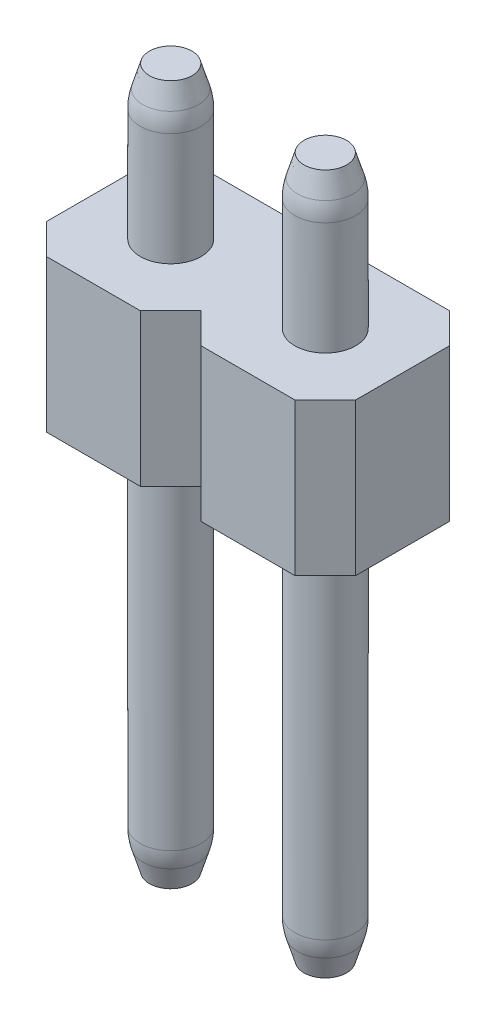
ISO-10303-21;
HEADER;
FILE_DESCRIPTION(('STEP AP214'),'2;1');
FILE_NAME('part.step','',(''),(''),'','','');
FILE_SCHEMA(('AUTOMOTIVE_DESIGN { 1 0 10303 214 1 1 1 1 }'));
ENDSEC;
DATA;
#1=APPLICATION_CONTEXT('core data for automotive mechanical design processes');
#2=APPLICATION_PROTOCOL_DEFINITION('international standard','automotive_design',2000,#1);
#3=PRODUCT_CONTEXT('',#1,'mechanical');
#4=PRODUCT('Part','Part','',(#3));
#5=PRODUCT_RELATED_PRODUCT_CATEGORY('part','',(#4));
#6=PRODUCT_DEFINITION_FORMATION('','',#4);
#7=PRODUCT_DEFINITION_CONTEXT('part definition',#1,'design');
#8=PRODUCT_DEFINITION('design','',#6,#7);
#9=PRODUCT_DEFINITION_SHAPE('','',#8);
#10=(LENGTH_UNIT() NAMED_UNIT(*) SI_UNIT(.MILLI.,.METRE.));
#11=(NAMED_UNIT(*) PLANE_ANGLE_UNIT() SI_UNIT($,.RADIAN.));
#12=(NAMED_UNIT(*) SI_UNIT($,.STERADIAN.) SOLID_ANGLE_UNIT());
#13=UNCERTAINTY_MEASURE_WITH_UNIT(LENGTH_MEASURE(1.E-05),#10,'distance_accuracy_value','');
#14=(GEOMETRIC_REPRESENTATION_CONTEXT(3) GLOBAL_UNCERTAINTY_ASSIGNED_CONTEXT((#13)) GLOBAL_UNIT_ASSIGNED_CONTEXT((#10,
#11,#12)) REPRESENTATION_CONTEXT('',''));
#15=CARTESIAN_POINT('',(0.,0.,0.));
#16=DIRECTION('',(0.,0.,1.));
#17=DIRECTION('',(1.,0.,0.));
#18=AXIS2_PLACEMENT_3D('',#15,#16,#17);
#19=CARTESIAN_POINT('',(0.,11.5,0.));
#20=DIRECTION('',(0.,-1.,0.));
#21=DIRECTION('',(0.,0.,-1.));
#22=AXIS2_PLACEMENT_3D('',#19,#20,#21);
#23=CYLINDRICAL_SURFACE('',#22,0.5);
#24=CARTESIAN_POINT('',(0.,10.8532311636965,0.));
#25=DIRECTION('',(0.,1.,0.));
#26=DIRECTION('',(0.,0.,1.));
#27=AXIS2_PLACEMENT_3D('',#24,#25,#26);
#28=CIRCLE('',#27,0.5);
#29=CARTESIAN_POINT('',(0.,10.8532311636965,0.5));
#30=VERTEX_POINT('',#29);
#31=EDGE_CURVE('E249',#30,#30,#28,.F.);
#32=ORIENTED_EDGE('',*,*,#31,.T.);
#33=EDGE_LOOP('',(#32));
#34=FACE_BOUND('',#33,.T.);
#35=CARTESIAN_POINT('',(0.,9.,0.));
#36=DIRECTION('',(0.,-1.,0.));
#37=DIRECTION('',(0.,0.,-1.));
#38=AXIS2_PLACEMENT_3D('',#35,#36,#37);
#39=CIRCLE('',#38,0.5);
#40=CARTESIAN_POINT('',(0.,9.,-0.5));
#41=VERTEX_POINT('',#40);
#42=EDGE_CURVE('E230',#41,#41,#39,.T.);
#43=ORIENTED_EDGE('',*,*,#42,.F.);
#44=EDGE_LOOP('',(#43));
#45=FACE_BOUND('',#44,.T.);
#46=ADVANCED_FACE('F40',(#34,#45),#23,.T.);
#47=CARTESIAN_POINT('',(0.,11.5,0.));
#48=DIRECTION('',(0.,1.,0.));
#49=DIRECTION('',(0.,0.,1.));
#50=AXIS2_PLACEMENT_3D('',#47,#48,#49);
#51=PLANE('',#50);
#52=CARTESIAN_POINT('',(0.,11.5,0.));
#53=DIRECTION('',(0.,1.,0.));
#54=DIRECTION('',(0.,0.,1.));
#55=AXIS2_PLACEMENT_3D('',#52,#53,#54);
#56=CIRCLE('',#55,0.350000000000005);
#57=CARTESIAN_POINT('',(0.,11.5,0.350000000000005));
#58=VERTEX_POINT('',#57);
#59=EDGE_CURVE('E240',#58,#58,#56,.T.);
#60=ORIENTED_EDGE('',*,*,#59,.T.);
#61=EDGE_LOOP('',(#60));
#62=FACE_BOUND('',#61,.T.);
#63=ADVANCED_FACE('F306',(#62),#51,.T.);
#64=CARTESIAN_POINT('',(-1.27,9.,0.77));
#65=DIRECTION('',(1.,0.,0.));
#66=DIRECTION('',(0.,0.,-1.));
#67=AXIS2_PLACEMENT_3D('',#64,#65,#66);
#68=PLANE('',#67);
#69=DIRECTION('',(0.,0.,1.));
#70=VECTOR('',#69,1.);
#71=CARTESIAN_POINT('',(-1.27,6.5,0.77));
#72=LINE('',#71,#70);
#73=CARTESIAN_POINT('',(-1.27,6.5,-0.77));
#74=VERTEX_POINT('',#73);
#75=CARTESIAN_POINT('',(-1.27,6.5,0.77));
#76=VERTEX_POINT('',#75);
#77=EDGE_CURVE('E169',#74,#76,#72,.T.);
#78=ORIENTED_EDGE('',*,*,#77,.T.);
#79=DIRECTION('',(0.,-1.,0.));
#80=VECTOR('',#79,1.);
#81=CARTESIAN_POINT('',(-1.27,9.,0.77));
#82=LINE('',#81,#80);
#83=CARTESIAN_POINT('',(-1.27,9.,0.77));
#84=VERTEX_POINT('',#83);
#85=EDGE_CURVE('E225',#84,#76,#82,.T.);
#86=ORIENTED_EDGE('',*,*,#85,.F.);
#87=DIRECTION('',(0.,0.,1.));
#88=VECTOR('',#87,1.);
#89=CARTESIAN_POINT('',(-1.27,9.,0.77));
#90=LINE('',#89,#88);
#91=CARTESIAN_POINT('',(-1.27,9.,-0.77));
#92=VERTEX_POINT('',#91);
#93=EDGE_CURVE('E195',#92,#84,#90,.T.);
#94=ORIENTED_EDGE('',*,*,#93,.F.);
#95=DIRECTION('',(0.,-1.,0.));
#96=VECTOR('',#95,1.);
#97=CARTESIAN_POINT('',(-1.27,9.,-0.77));
#98=LINE('',#97,#96);
#99=EDGE_CURVE('E165',#92,#74,#98,.T.);
#100=ORIENTED_EDGE('',*,*,#99,.T.);
#101=EDGE_LOOP('',(#78,#86,#94,#100));
#102=FACE_BOUND('',#101,.T.);
#103=ADVANCED_FACE('F311',(#102),#68,.F.);
#104=CARTESIAN_POINT('',(-1.27,9.,0.77));
#105=DIRECTION('',(0.707106781186548,0.,-0.707106781186548));
#106=DIRECTION('',(-0.707106781186548,0.,-0.707106781186548));
#107=AXIS2_PLACEMENT_3D('',#104,#105,#106);
#108=PLANE('',#107);
#109=DIRECTION('',(0.707106781186548,0.,0.707106781186548));
#110=VECTOR('',#109,1.);
#111=CARTESIAN_POINT('',(-1.27,6.5,0.77));
#112=LINE('',#111,#110);
#113=CARTESIAN_POINT('',(-0.77,6.5,1.27));
#114=VERTEX_POINT('',#113);
#115=EDGE_CURVE('E172',#76,#114,#112,.T.);
#116=ORIENTED_EDGE('',*,*,#115,.T.);
#117=DIRECTION('',(0.,-1.,0.));
#118=VECTOR('',#117,1.);
#119=CARTESIAN_POINT('',(-0.77,9.,1.27));
#120=LINE('',#119,#118);
#121=CARTESIAN_POINT('',(-0.77,9.,1.27));
#122=VERTEX_POINT('',#121);
#123=EDGE_CURVE('E222',#122,#114,#120,.T.);
#124=ORIENTED_EDGE('',*,*,#123,.F.);
#125=DIRECTION('',(0.707106781186548,0.,0.707106781186548));
#126=VECTOR('',#125,1.);
#127=CARTESIAN_POINT('',(-1.27,9.,0.77));
#128=LINE('',#127,#126);
#129=EDGE_CURVE('E117',#84,#122,#128,.T.);
#130=ORIENTED_EDGE('',*,*,#129,.F.);
#131=ORIENTED_EDGE('',*,*,#85,.T.);
#132=EDGE_LOOP('',(#116,#124,#130,#131));
#133=FACE_BOUND('',#132,.T.);
#134=ADVANCED_FACE('F405',(#133),#108,.F.);
#135=CARTESIAN_POINT('',(-0.77,9.,1.27));
#136=DIRECTION('',(0.,0.,-1.));
#137=DIRECTION('',(-1.,0.,0.));
#138=AXIS2_PLACEMENT_3D('',#135,#136,#137);
#139=PLANE('',#138);
#140=DIRECTION('',(1.,0.,0.));
#141=VECTOR('',#140,1.);
#142=CARTESIAN_POINT('',(-0.77,6.5,1.27));
#143=LINE('',#142,#141);
#144=CARTESIAN_POINT('',(0.77,6.5,1.27));
#145=VERTEX_POINT('',#144);
#146=EDGE_CURVE('E175',#114,#145,#143,.T.);
#147=ORIENTED_EDGE('',*,*,#146,.T.);
#148=DIRECTION('',(0.,-1.,0.));
#149=VECTOR('',#148,1.);
#150=CARTESIAN_POINT('',(0.77,9.,1.27));
#151=LINE('',#150,#149);
#152=CARTESIAN_POINT('',(0.77,9.,1.27));
#153=VERTEX_POINT('',#152);
#154=EDGE_CURVE('E219',#153,#145,#151,.T.);
#155=ORIENTED_EDGE('',*,*,#154,.F.);
#156=DIRECTION('',(1.,0.,0.));
#157=VECTOR('',#156,1.);
#158=CARTESIAN_POINT('',(-0.77,9.,1.27));
#159=LINE('',#158,#157);
#160=EDGE_CURVE('E402',#122,#153,#159,.T.);
#161=ORIENTED_EDGE('',*,*,#160,.F.);
#162=ORIENTED_EDGE('',*,*,#123,.T.);
#163=EDGE_LOOP('',(#147,#155,#161,#162));
#164=FACE_BOUND('',#163,.T.);
#165=ADVANCED_FACE('F401',(#164),#139,.F.);
#166=CARTESIAN_POINT('',(0.77,9.,1.27));
#167=DIRECTION('',(-0.707106781186548,0.,-0.707106781186548));
#168=DIRECTION('',(-0.707106781186548,0.,0.707106781186548));
#169=AXIS2_PLACEMENT_3D('',#166,#167,#168);
#170=PLANE('',#169);
#171=DIRECTION('',(0.707106781186548,0.,-0.707106781186548));
#172=VECTOR('',#171,1.);
#173=CARTESIAN_POINT('',(0.77,6.5,1.27));
#174=LINE('',#173,#172);
#175=CARTESIAN_POINT('',(1.27,6.5,0.77));
#176=VERTEX_POINT('',#175);
#177=EDGE_CURVE('E177',#145,#176,#174,.T.);
#178=ORIENTED_EDGE('',*,*,#177,.T.);
#179=DIRECTION('',(0.,-1.,0.));
#180=VECTOR('',#179,1.);
#181=CARTESIAN_POINT('',(1.27,9.,0.77));
#182=LINE('',#181,#180);
#183=CARTESIAN_POINT('',(1.27,9.,0.77));
#184=VERTEX_POINT('',#183);
#185=EDGE_CURVE('E216',#184,#176,#182,.T.);
#186=ORIENTED_EDGE('',*,*,#185,.F.);
#187=DIRECTION('',(0.707106781186548,0.,-0.707106781186548));
#188=VECTOR('',#187,1.);
#189=CARTESIAN_POINT('',(0.77,9.,1.27));
#190=LINE('',#189,#188);
#191=EDGE_CURVE('E397',#153,#184,#190,.T.);
#192=ORIENTED_EDGE('',*,*,#191,.F.);
#193=ORIENTED_EDGE('',*,*,#154,.T.);
#194=EDGE_LOOP('',(#178,#186,#192,#193));
#195=FACE_BOUND('',#194,.T.);
#196=ADVANCED_FACE('F396',(#195),#170,.F.);
#197=CARTESIAN_POINT('',(1.27,9.,0.77));
#198=DIRECTION('',(0.707106781186548,0.,-0.707106781186548));
#199=DIRECTION('',(-0.707106781186548,0.,-0.707106781186548));
#200=AXIS2_PLACEMENT_3D('',#197,#198,#199);
#201=PLANE('',#200);
#202=DIRECTION('',(0.707106781186548,0.,0.707106781186548));
#203=VECTOR('',#202,1.);
#204=CARTESIAN_POINT('',(1.27,6.5,0.77));
#205=LINE('',#204,#203);
#206=CARTESIAN_POINT('',(1.77,6.5,1.27));
#207=VERTEX_POINT('',#206);
#208=EDGE_CURVE('E179',#176,#207,#205,.T.);
#209=ORIENTED_EDGE('',*,*,#208,.T.);
#210=DIRECTION('',(0.,-1.,0.));
#211=VECTOR('',#210,1.);
#212=CARTESIAN_POINT('',(1.77,9.,1.27));
#213=LINE('',#212,#211);
#214=CARTESIAN_POINT('',(1.77,9.,1.27));
#215=VERTEX_POINT('',#214);
#216=EDGE_CURVE('E213',#215,#207,#213,.T.);
#217=ORIENTED_EDGE('',*,*,#216,.F.);
#218=DIRECTION('',(0.707106781186548,0.,0.707106781186548));
#219=VECTOR('',#218,1.);
#220=CARTESIAN_POINT('',(1.27,9.,0.77));
#221=LINE('',#220,#219);
#222=EDGE_CURVE('E393',#184,#215,#221,.T.);
#223=ORIENTED_EDGE('',*,*,#222,.F.);
#224=ORIENTED_EDGE('',*,*,#185,.T.);
#225=EDGE_LOOP('',(#209,#217,#223,#224));
#226=FACE_BOUND('',#225,.T.);
#227=ADVANCED_FACE('F390',(#226),#201,.F.);
#228=CARTESIAN_POINT('',(1.77,9.,1.27));
#229=DIRECTION('',(0.,0.,-1.));
#230=DIRECTION('',(-1.,0.,0.));
#231=AXIS2_PLACEMENT_3D('',#228,#229,#230);
#232=PLANE('',#231);
#233=DIRECTION('',(1.,0.,0.));
#234=VECTOR('',#233,1.);
#235=CARTESIAN_POINT('',(1.77,6.5,1.27));
#236=LINE('',#235,#234);
#237=CARTESIAN_POINT('',(3.31,6.5,1.27));
#238=VERTEX_POINT('',#237);
#239=EDGE_CURVE('E181',#207,#238,#236,.T.);
#240=ORIENTED_EDGE('',*,*,#239,.T.);
#241=DIRECTION('',(0.,-1.,0.));
#242=VECTOR('',#241,1.);
#243=CARTESIAN_POINT('',(3.31,9.,1.27));
#244=LINE('',#243,#242);
#245=CARTESIAN_POINT('',(3.31,9.,1.27));
#246=VERTEX_POINT('',#245);
#247=EDGE_CURVE('E210',#246,#238,#244,.T.);
#248=ORIENTED_EDGE('',*,*,#247,.F.);
#249=DIRECTION('',(1.,0.,0.));
#250=VECTOR('',#249,1.);
#251=CARTESIAN_POINT('',(1.77,9.,1.27));
#252=LINE('',#251,#250);
#253=EDGE_CURVE('E384',#215,#246,#252,.T.);
#254=ORIENTED_EDGE('',*,*,#253,.F.);
#255=ORIENTED_EDGE('',*,*,#216,.T.);
#256=EDGE_LOOP('',(#240,#248,#254,#255));
#257=FACE_BOUND('',#256,.T.);
#258=ADVANCED_FACE('F383',(#257),#232,.F.);
#259=CARTESIAN_POINT('',(3.31,9.,1.27));
#260=DIRECTION('',(-0.707106781186548,0.,-0.707106781186548));
#261=DIRECTION('',(-0.707106781186548,0.,0.707106781186548));
#262=AXIS2_PLACEMENT_3D('',#259,#260,#261);
#263=PLANE('',#262);
#264=DIRECTION('',(0.707106781186548,0.,-0.707106781186548));
#265=VECTOR('',#264,1.);
#266=CARTESIAN_POINT('',(3.31,6.5,1.27));
#267=LINE('',#266,#265);
#268=CARTESIAN_POINT('',(3.81,6.5,0.77));
#269=VERTEX_POINT('',#268);
#270=EDGE_CURVE('E183',#238,#269,#267,.T.);
#271=ORIENTED_EDGE('',*,*,#270,.T.);
#272=DIRECTION('',(0.,-1.,0.));
#273=VECTOR('',#272,1.);
#274=CARTESIAN_POINT('',(3.81,9.,0.77));
#275=LINE('',#274,#273);
#276=CARTESIAN_POINT('',(3.81,9.,0.77));
#277=VERTEX_POINT('',#276);
#278=EDGE_CURVE('E208',#277,#269,#275,.T.);
#279=ORIENTED_EDGE('',*,*,#278,.F.);
#280=DIRECTION('',(0.707106781186548,0.,-0.707106781186548));
#281=VECTOR('',#280,1.);
#282=CARTESIAN_POINT('',(3.31,9.,1.27));
#283=LINE('',#282,#281);
#284=EDGE_CURVE('E380',#246,#277,#283,.T.);
#285=ORIENTED_EDGE('',*,*,#284,.F.);
#286=ORIENTED_EDGE('',*,*,#247,.T.);
#287=EDGE_LOOP('',(#271,#279,#285,#286));
#288=FACE_BOUND('',#287,.T.);
#289=ADVANCED_FACE('F378',(#288),#263,.F.);
#290=CARTESIAN_POINT('',(3.31,9.,-1.27));
#291=DIRECTION('',(-0.707106781186548,0.,0.707106781186548));
#292=DIRECTION('',(0.707106781186548,0.,0.707106781186548));
#293=AXIS2_PLACEMENT_3D('',#290,#291,#292);
#294=PLANE('',#293);
#295=DIRECTION('',(-0.707106781186548,0.,-0.707106781186548));
#296=VECTOR('',#295,1.);
#297=CARTESIAN_POINT('',(3.31,6.5,-1.27));
#298=LINE('',#297,#296);
#299=CARTESIAN_POINT('',(3.81,6.5,-0.77));
#300=VERTEX_POINT('',#299);
#301=CARTESIAN_POINT('',(3.31,6.5,-1.27));
#302=VERTEX_POINT('',#301);
#303=EDGE_CURVE('E186',#300,#302,#298,.T.);
#304=ORIENTED_EDGE('',*,*,#303,.T.);
#305=DIRECTION('',(0.,-1.,0.));
#306=VECTOR('',#305,1.);
#307=CARTESIAN_POINT('',(3.31,9.,-1.27));
#308=LINE('',#307,#306);
#309=CARTESIAN_POINT('',(3.31,9.,-1.27));
#310=VERTEX_POINT('',#309);
#311=EDGE_CURVE('E202',#310,#302,#308,.T.);
#312=ORIENTED_EDGE('',*,*,#311,.F.);
#313=DIRECTION('',(-0.707106781186548,0.,-0.707106781186548));
#314=VECTOR('',#313,1.);
#315=CARTESIAN_POINT('',(3.31,9.,-1.27));
#316=LINE('',#315,#314);
#317=CARTESIAN_POINT('',(3.81,9.,-0.77));
#318=VERTEX_POINT('',#317);
#319=EDGE_CURVE('E421',#318,#310,#316,.T.);
#320=ORIENTED_EDGE('',*,*,#319,.F.);
#321=DIRECTION('',(0.,-1.,0.));
#322=VECTOR('',#321,1.);
#323=CARTESIAN_POINT('',(3.81,9.,-0.77));
#324=LINE('',#323,#322);
#325=EDGE_CURVE('E205',#318,#300,#324,.T.);
#326=ORIENTED_EDGE('',*,*,#325,.T.);
#327=EDGE_LOOP('',(#304,#312,#320,#326));
#328=FACE_BOUND('',#327,.T.);
#329=ADVANCED_FACE('F419',(#328),#294,.F.);
#330=CARTESIAN_POINT('',(1.77,9.,-1.27));
#331=DIRECTION('',(0.,0.,1.));
#332=DIRECTION('',(1.,0.,0.));
#333=AXIS2_PLACEMENT_3D('',#330,#331,#332);
#334=PLANE('',#333);
#335=DIRECTION('',(-1.,0.,0.));
#336=VECTOR('',#335,1.);
#337=CARTESIAN_POINT('',(1.77,6.5,-1.27));
#338=LINE('',#337,#336);
#339=CARTESIAN_POINT('',(1.77,6.5,-1.27));
#340=VERTEX_POINT('',#339);
#341=EDGE_CURVE('E188',#302,#340,#338,.T.);
#342=ORIENTED_EDGE('',*,*,#341,.T.);
#343=DIRECTION('',(0.,-1.,0.));
#344=VECTOR('',#343,1.);
#345=CARTESIAN_POINT('',(1.77,9.,-1.27));
#346=LINE('',#345,#344);
#347=CARTESIAN_POINT('',(1.77,9.,-1.27));
#348=VERTEX_POINT('',#347);
#349=EDGE_CURVE('E199',#348,#340,#346,.T.);
#350=ORIENTED_EDGE('',*,*,#349,.F.);
#351=DIRECTION('',(-1.,0.,0.));
#352=VECTOR('',#351,1.);
#353=CARTESIAN_POINT('',(1.77,9.,-1.27));
#354=LINE('',#353,#352);
#355=EDGE_CURVE('E415',#310,#348,#354,.T.);
#356=ORIENTED_EDGE('',*,*,#355,.F.);
#357=ORIENTED_EDGE('',*,*,#311,.T.);
#358=EDGE_LOOP('',(#342,#350,#356,#357));
#359=FACE_BOUND('',#358,.T.);
#360=ADVANCED_FACE('F414',(#359),#334,.F.);
#361=CARTESIAN_POINT('',(1.27,9.,-0.77));
#362=DIRECTION('',(0.707106781186548,0.,0.707106781186548));
#363=DIRECTION('',(0.707106781186548,0.,-0.707106781186548));
#364=AXIS2_PLACEMENT_3D('',#361,#362,#363);
#365=PLANE('',#364);
#366=DIRECTION('',(-0.707106781186548,0.,0.707106781186548));
#367=VECTOR('',#366,1.);
#368=CARTESIAN_POINT('',(1.27,6.5,-0.77));
#369=LINE('',#368,#367);
#370=CARTESIAN_POINT('',(1.27,6.5,-0.77));
#371=VERTEX_POINT('',#370);
#372=EDGE_CURVE('E190',#340,#371,#369,.T.);
#373=ORIENTED_EDGE('',*,*,#372,.T.);
#374=DIRECTION('',(0.,-1.,0.));
#375=VECTOR('',#374,1.);
#376=CARTESIAN_POINT('',(1.27,9.,-0.77));
#377=LINE('',#376,#375);
#378=CARTESIAN_POINT('',(1.27,9.,-0.77));
#379=VERTEX_POINT('',#378);
#380=EDGE_CURVE('E160',#379,#371,#377,.T.);
#381=ORIENTED_EDGE('',*,*,#380,.F.);
#382=DIRECTION('',(-0.707106781186548,0.,0.707106781186548));
#383=VECTOR('',#382,1.);
#384=CARTESIAN_POINT('',(1.27,9.,-0.77));
#385=LINE('',#384,#383);
#386=EDGE_CURVE('E151',#348,#379,#385,.T.);
#387=ORIENTED_EDGE('',*,*,#386,.F.);
#388=ORIENTED_EDGE('',*,*,#349,.T.);
#389=EDGE_LOOP('',(#373,#381,#387,#388));
#390=FACE_BOUND('',#389,.T.);
#391=ADVANCED_FACE('F410',(#390),#365,.F.);
#392=CARTESIAN_POINT('',(0.77,9.,-1.27));
#393=DIRECTION('',(-0.707106781186548,0.,0.707106781186548));
#394=DIRECTION('',(0.707106781186548,0.,0.707106781186548));
#395=AXIS2_PLACEMENT_3D('',#392,#393,#394);
#396=PLANE('',#395);
#397=DIRECTION('',(-0.707106781186548,0.,-0.707106781186548));
#398=VECTOR('',#397,1.);
#399=CARTESIAN_POINT('',(0.77,6.5,-1.27));
#400=LINE('',#399,#398);
#401=CARTESIAN_POINT('',(0.77,6.5,-1.27));
#402=VERTEX_POINT('',#401);
#403=EDGE_CURVE('E159',#371,#402,#400,.T.);
#404=ORIENTED_EDGE('',*,*,#403,.T.);
#405=DIRECTION('',(0.,-1.,0.));
#406=VECTOR('',#405,1.);
#407=CARTESIAN_POINT('',(0.77,9.,-1.27));
#408=LINE('',#407,#406);
#409=CARTESIAN_POINT('',(0.77,9.,-1.27));
#410=VERTEX_POINT('',#409);
#411=EDGE_CURVE('E156',#410,#402,#408,.T.);
#412=ORIENTED_EDGE('',*,*,#411,.F.);
#413=DIRECTION('',(-0.707106781186548,0.,-0.707106781186548));
#414=VECTOR('',#413,1.);
#415=CARTESIAN_POINT('',(0.77,9.,-1.27));
#416=LINE('',#415,#414);
#417=EDGE_CURVE('E144',#379,#410,#416,.T.);
#418=ORIENTED_EDGE('',*,*,#417,.F.);
#419=ORIENTED_EDGE('',*,*,#380,.T.);
#420=EDGE_LOOP('',(#404,#412,#418,#419));
#421=FACE_BOUND('',#420,.T.);
#422=ADVANCED_FACE('F157',(#421),#396,.F.);
#423=CARTESIAN_POINT('',(-0.77,9.,-1.27));
#424=DIRECTION('',(0.,0.,1.));
#425=DIRECTION('',(1.,0.,0.));
#426=AXIS2_PLACEMENT_3D('',#423,#424,#425);
#427=PLANE('',#426);
#428=DIRECTION('',(-1.,0.,0.));
#429=VECTOR('',#428,1.);
#430=CARTESIAN_POINT('',(-0.77,6.5,-1.27));
#431=LINE('',#430,#429);
#432=CARTESIAN_POINT('',(-0.77,6.5,-1.27));
#433=VERTEX_POINT('',#432);
#434=EDGE_CURVE('E102',#402,#433,#431,.T.);
#435=ORIENTED_EDGE('',*,*,#434,.T.);
#436=DIRECTION('',(0.,-1.,0.));
#437=VECTOR('',#436,1.);
#438=CARTESIAN_POINT('',(-0.77,9.,-1.27));
#439=LINE('',#438,#437);
#440=CARTESIAN_POINT('',(-0.77,9.,-1.27));
#441=VERTEX_POINT('',#440);
#442=EDGE_CURVE('E161',#441,#433,#439,.T.);
#443=ORIENTED_EDGE('',*,*,#442,.F.);
#444=DIRECTION('',(-1.,0.,0.));
#445=VECTOR('',#444,1.);
#446=CARTESIAN_POINT('',(-0.77,9.,-1.27));
#447=LINE('',#446,#445);
#448=EDGE_CURVE('E149',#410,#441,#447,.T.);
#449=ORIENTED_EDGE('',*,*,#448,.F.);
#450=ORIENTED_EDGE('',*,*,#411,.T.);
#451=EDGE_LOOP('',(#435,#443,#449,#450));
#452=FACE_BOUND('',#451,.T.);
#453=ADVANCED_FACE('F163',(#452),#427,.F.);
#454=CARTESIAN_POINT('',(-1.27,9.,-0.77));
#455=DIRECTION('',(0.707106781186548,0.,0.707106781186548));
#456=DIRECTION('',(0.707106781186548,0.,-0.707106781186548));
#457=AXIS2_PLACEMENT_3D('',#454,#455,#456);
#458=PLANE('',#457);
#459=DIRECTION('',(-0.707106781186548,0.,0.707106781186548));
#460=VECTOR('',#459,1.);
#461=CARTESIAN_POINT('',(-1.27,6.5,-0.77));
#462=LINE('',#461,#460);
#463=EDGE_CURVE('E108',#433,#74,#462,.T.);
#464=ORIENTED_EDGE('',*,*,#463,.T.);
#465=ORIENTED_EDGE('',*,*,#99,.F.);
#466=DIRECTION('',(-0.707106781186548,0.,0.707106781186548));
#467=VECTOR('',#466,1.);
#468=CARTESIAN_POINT('',(-1.27,9.,-0.77));
#469=LINE('',#468,#467);
#470=EDGE_CURVE('E57',#441,#92,#469,.T.);
#471=ORIENTED_EDGE('',*,*,#470,.F.);
#472=ORIENTED_EDGE('',*,*,#442,.T.);
#473=EDGE_LOOP('',(#464,#465,#471,#472));
#474=FACE_BOUND('',#473,.T.);
#475=ADVANCED_FACE('F299',(#474),#458,.F.);
#476=CARTESIAN_POINT('',(0.,9.,0.));
#477=DIRECTION('',(0.,-1.,0.));
#478=DIRECTION('',(0.,0.,-1.));
#479=AXIS2_PLACEMENT_3D('',#476,#477,#478);
#480=PLANE('',#479);
#481=CARTESIAN_POINT('',(2.54,9.,0.));
#482=DIRECTION('',(0.,-1.,0.));
#483=DIRECTION('',(0.,0.,-1.));
#484=AXIS2_PLACEMENT_3D('',#481,#482,#483);
#485=CIRCLE('',#484,0.5);
#486=CARTESIAN_POINT('',(2.54,9.,-0.5));
#487=VERTEX_POINT('',#486);
#488=EDGE_CURVE('E233',#487,#487,#485,.F.);
#489=ORIENTED_EDGE('',*,*,#488,.F.);
#490=EDGE_LOOP('',(#489));
#491=FACE_BOUND('',#490,.T.);
#492=ORIENTED_EDGE('',*,*,#42,.T.);
#493=EDGE_LOOP('',(#492));
#494=FACE_BOUND('',#493,.T.);
#495=ORIENTED_EDGE('',*,*,#284,.T.);
#496=DIRECTION('',(0.,0.,-1.));
#497=VECTOR('',#496,1.);
#498=CARTESIAN_POINT('',(3.81,9.,0.));
#499=LINE('',#498,#497);
#500=EDGE_CURVE('E236',#277,#318,#499,.T.);
#501=ORIENTED_EDGE('',*,*,#500,.T.);
#502=ORIENTED_EDGE('',*,*,#319,.T.);
#503=ORIENTED_EDGE('',*,*,#355,.T.);
#504=ORIENTED_EDGE('',*,*,#386,.T.);
#505=ORIENTED_EDGE('',*,*,#417,.T.);
#506=ORIENTED_EDGE('',*,*,#448,.T.);
#507=ORIENTED_EDGE('',*,*,#470,.T.);
#508=ORIENTED_EDGE('',*,*,#93,.T.);
#509=ORIENTED_EDGE('',*,*,#129,.T.);
#510=ORIENTED_EDGE('',*,*,#160,.T.);
#511=ORIENTED_EDGE('',*,*,#191,.T.);
#512=ORIENTED_EDGE('',*,*,#222,.T.);
#513=ORIENTED_EDGE('',*,*,#253,.T.);
#514=EDGE_LOOP('',(#495,#501,#502,#503,#504,#505,#506,#507,#508,#509,#510,#511,#512,#513));
#515=FACE_BOUND('',#514,.T.);
#516=ADVANCED_FACE('F147',(#491,#494,#515),#480,.F.);
#517=CARTESIAN_POINT('',(0.,6.5,0.));
#518=DIRECTION('',(0.,-1.,0.));
#519=DIRECTION('',(0.,0.,-1.));
#520=AXIS2_PLACEMENT_3D('',#517,#518,#519);
#521=PLANE('',#520);
#522=DIRECTION('',(0.,0.,-1.));
#523=VECTOR('',#522,1.);
#524=CARTESIAN_POINT('',(3.81,6.5,0.));
#525=LINE('',#524,#523);
#526=EDGE_CURVE('E11',#269,#300,#525,.T.);
#527=ORIENTED_EDGE('',*,*,#526,.F.);
#528=ORIENTED_EDGE('',*,*,#270,.F.);
#529=ORIENTED_EDGE('',*,*,#239,.F.);
#530=ORIENTED_EDGE('',*,*,#208,.F.);
#531=ORIENTED_EDGE('',*,*,#177,.F.);
#532=ORIENTED_EDGE('',*,*,#146,.F.);
#533=ORIENTED_EDGE('',*,*,#115,.F.);
#534=ORIENTED_EDGE('',*,*,#77,.F.);
#535=ORIENTED_EDGE('',*,*,#463,.F.);
#536=ORIENTED_EDGE('',*,*,#434,.F.);
#537=ORIENTED_EDGE('',*,*,#403,.F.);
#538=ORIENTED_EDGE('',*,*,#372,.F.);
#539=ORIENTED_EDGE('',*,*,#341,.F.);
#540=ORIENTED_EDGE('',*,*,#303,.F.);
#541=EDGE_LOOP('',(#527,#528,#529,#530,#531,#532,#533,#534,#535,#536,#537,#538,#539,#540));
#542=FACE_BOUND('',#541,.T.);
#543=CARTESIAN_POINT('',(2.54,6.5,0.));
#544=DIRECTION('',(0.,-1.,0.));
#545=DIRECTION('',(0.,0.,-1.));
#546=AXIS2_PLACEMENT_3D('',#543,#544,#545);
#547=CIRCLE('',#546,0.5);
#548=CARTESIAN_POINT('',(2.54,6.5,-0.5));
#549=VERTEX_POINT('',#548);
#550=EDGE_CURVE('E173',#549,#549,#547,.F.);
#551=ORIENTED_EDGE('',*,*,#550,.T.);
#552=EDGE_LOOP('',(#551));
#553=FACE_BOUND('',#552,.T.);
#554=CARTESIAN_POINT('',(0.,6.5,0.));
#555=DIRECTION('',(0.,-1.,0.));
#556=DIRECTION('',(0.,0.,-1.));
#557=AXIS2_PLACEMENT_3D('',#554,#555,#556);
#558=CIRCLE('',#557,0.5);
#559=CARTESIAN_POINT('',(0.,6.5,-0.5));
#560=VERTEX_POINT('',#559);
#561=EDGE_CURVE('E227',#560,#560,#558,.T.);
#562=ORIENTED_EDGE('',*,*,#561,.F.);
#563=EDGE_LOOP('',(#562));
#564=FACE_BOUND('',#563,.T.);
#565=ADVANCED_FACE('F289',(#542,#553,#564),#521,.T.);
#566=CARTESIAN_POINT('',(0.,0.,0.));
#567=DIRECTION('',(0.,1.,0.));
#568=DIRECTION('',(0.,0.,1.));
#569=AXIS2_PLACEMENT_3D('',#566,#567,#568);
#570=PLANE('',#569);
#571=CARTESIAN_POINT('',(0.,0.,0.));
#572=DIRECTION('',(0.,1.,0.));
#573=DIRECTION('',(0.,0.,1.));
#574=AXIS2_PLACEMENT_3D('',#571,#572,#573);
#575=CIRCLE('',#574,0.349999999999994);
#576=CARTESIAN_POINT('',(0.,0.,0.349999999999994));
#577=VERTEX_POINT('',#576);
#578=EDGE_CURVE('E255',#577,#577,#575,.F.);
#579=ORIENTED_EDGE('',*,*,#578,.T.);
#580=EDGE_LOOP('',(#579));
#581=FACE_BOUND('',#580,.T.);
#582=ADVANCED_FACE('F285',(#581),#570,.F.);
#583=CARTESIAN_POINT('',(0.,0.646768836303538,0.));
#584=DIRECTION('',(0.,-1.,0.));
#585=DIRECTION('',(0.,0.,-1.));
#586=AXIS2_PLACEMENT_3D('',#583,#584,#585);
#587=CIRCLE('',#586,0.5);
#588=CARTESIAN_POINT('',(0.,0.646768836303538,-0.5));
#589=VERTEX_POINT('',#588);
#590=EDGE_CURVE('E267',#589,#589,#587,.F.);
#591=ORIENTED_EDGE('',*,*,#590,.T.);
#592=EDGE_LOOP('',(#591));
#593=FACE_BOUND('',#592,.T.);
#594=ORIENTED_EDGE('',*,*,#561,.T.);
#595=EDGE_LOOP('',(#594));
#596=FACE_BOUND('',#595,.T.);
#597=ADVANCED_FACE('F281',(#593,#596),#23,.T.);
#598=CARTESIAN_POINT('',(2.54,0.,0.));
#599=DIRECTION('',(0.,1.,0.));
#600=DIRECTION('',(0.,0.,1.));
#601=AXIS2_PLACEMENT_3D('',#598,#599,#600);
#602=PLANE('',#601);
#603=CARTESIAN_POINT('',(2.54,0.,0.));
#604=DIRECTION('',(0.,1.,0.));
#605=DIRECTION('',(0.,0.,1.));
#606=AXIS2_PLACEMENT_3D('',#603,#604,#605);
#607=CIRCLE('',#606,0.349999999999994);
#608=CARTESIAN_POINT('',(2.54,0.,0.349999999999994));
#609=VERTEX_POINT('',#608);
#610=EDGE_CURVE('E258',#609,#609,#607,.F.);
#611=ORIENTED_EDGE('',*,*,#610,.T.);
#612=EDGE_LOOP('',(#611));
#613=FACE_BOUND('',#612,.T.);
#614=ADVANCED_FACE('F284',(#613),#602,.F.);
#615=CARTESIAN_POINT('',(2.54,11.5,0.));
#616=DIRECTION('',(0.,-1.,0.));
#617=DIRECTION('',(0.,0.,-1.));
#618=AXIS2_PLACEMENT_3D('',#615,#616,#617);
#619=CYLINDRICAL_SURFACE('',#618,0.5);
#620=CARTESIAN_POINT('',(2.54,0.646768836303539,0.));
#621=DIRECTION('',(0.,-1.,0.));
#622=DIRECTION('',(0.,0.,-1.));
#623=AXIS2_PLACEMENT_3D('',#620,#621,#622);
#624=CIRCLE('',#623,0.5);
#625=CARTESIAN_POINT('',(2.54,0.646768836303539,-0.5));
#626=VERTEX_POINT('',#625);
#627=EDGE_CURVE('E261',#626,#626,#624,.F.);
#628=ORIENTED_EDGE('',*,*,#627,.T.);
#629=EDGE_LOOP('',(#628));
#630=FACE_BOUND('',#629,.T.);
#631=ORIENTED_EDGE('',*,*,#550,.F.);
#632=EDGE_LOOP('',(#631));
#633=FACE_BOUND('',#632,.T.);
#634=ADVANCED_FACE('F346',(#630,#633),#619,.T.);
#635=CARTESIAN_POINT('',(2.54,10.8532311636965,0.));
#636=DIRECTION('',(0.,1.,0.));
#637=DIRECTION('',(0.,0.,1.));
#638=AXIS2_PLACEMENT_3D('',#635,#636,#637);
#639=CIRCLE('',#638,0.5);
#640=CARTESIAN_POINT('',(2.54,10.8532311636965,0.5));
#641=VERTEX_POINT('',#640);
#642=EDGE_CURVE('E243',#641,#641,#639,.F.);
#643=ORIENTED_EDGE('',*,*,#642,.T.);
#644=EDGE_LOOP('',(#643));
#645=FACE_BOUND('',#644,.T.);
#646=ORIENTED_EDGE('',*,*,#488,.T.);
#647=EDGE_LOOP('',(#646));
#648=FACE_BOUND('',#647,.T.);
#649=ADVANCED_FACE('F349',(#645,#648),#619,.T.);
#650=CARTESIAN_POINT('',(2.54,11.5,0.));
#651=DIRECTION('',(0.,1.,0.));
#652=DIRECTION('',(0.,0.,1.));
#653=AXIS2_PLACEMENT_3D('',#650,#651,#652);
#654=PLANE('',#653);
#655=CARTESIAN_POINT('',(2.54,11.5,0.));
#656=DIRECTION('',(0.,1.,0.));
#657=DIRECTION('',(0.,0.,1.));
#658=AXIS2_PLACEMENT_3D('',#655,#656,#657);
#659=CIRCLE('',#658,0.350000000000005);
#660=CARTESIAN_POINT('',(2.54,11.5,0.350000000000005));
#661=VERTEX_POINT('',#660);
#662=EDGE_CURVE('E237',#661,#661,#659,.T.);
#663=ORIENTED_EDGE('',*,*,#662,.T.);
#664=EDGE_LOOP('',(#663));
#665=FACE_BOUND('',#664,.T.);
#666=ADVANCED_FACE('F320',(#665),#654,.T.);
#667=CARTESIAN_POINT('',(2.54,11.5,0.));
#668=DIRECTION('',(0.,-1.,0.));
#669=DIRECTION('',(0.,0.,-1.));
#670=AXIS2_PLACEMENT_3D('',#667,#668,#669);
#671=CONICAL_SURFACE('',#670,0.350000000000005,0.291456794477863);
#672=CARTESIAN_POINT('',(2.54,11.1405790492628,0.));
#673=DIRECTION('',(0.,-1.,0.));
#674=DIRECTION('',(0.,0.,-1.));
#675=AXIS2_PLACEMENT_3D('',#672,#673,#674);
#676=CIRCLE('',#675,0.457826285221152);
#677=CARTESIAN_POINT('',(2.54,11.1405790492628,-0.457826285221152));
#678=VERTEX_POINT('',#677);
#679=EDGE_CURVE('E246',#678,#678,#676,.F.);
#680=ORIENTED_EDGE('',*,*,#679,.T.);
#681=EDGE_LOOP('',(#680));
#682=FACE_BOUND('',#681,.T.);
#683=ORIENTED_EDGE('',*,*,#662,.F.);
#684=EDGE_LOOP('',(#683));
#685=FACE_BOUND('',#684,.T.);
#686=ADVANCED_FACE('F316',(#682,#685),#671,.T.);
#687=CARTESIAN_POINT('',(0.,11.5,0.));
#688=DIRECTION('',(0.,-1.,0.));
#689=DIRECTION('',(0.,0.,-1.));
#690=AXIS2_PLACEMENT_3D('',#687,#688,#689);
#691=CONICAL_SURFACE('',#690,0.350000000000005,0.291456794477864);
#692=CARTESIAN_POINT('',(0.,11.1405790492628,0.));
#693=DIRECTION('',(0.,-1.,0.));
#694=DIRECTION('',(0.,0.,-1.));
#695=AXIS2_PLACEMENT_3D('',#692,#693,#694);
#696=CIRCLE('',#695,0.457826285221153);
#697=CARTESIAN_POINT('',(0.,11.1405790492628,-0.457826285221153));
#698=VERTEX_POINT('',#697);
#699=EDGE_CURVE('E252',#698,#698,#696,.F.);
#700=ORIENTED_EDGE('',*,*,#699,.T.);
#701=EDGE_LOOP('',(#700));
#702=FACE_BOUND('',#701,.T.);
#703=ORIENTED_EDGE('',*,*,#59,.F.);
#704=EDGE_LOOP('',(#703));
#705=FACE_BOUND('',#704,.T.);
#706=ADVANCED_FACE('F319',(#702,#705),#691,.T.);
#707=CARTESIAN_POINT('',(2.54,10.8532311636965,0.));
#708=DIRECTION('',(0.,1.,0.));
#709=DIRECTION('',(0.,0.,1.));
#710=AXIS2_PLACEMENT_3D('',#707,#708,#709);
#711=DEGENERATE_TOROIDAL_SURFACE('',#710,0.5,1.,.F.);
#712=ORIENTED_EDGE('',*,*,#679,.F.);
#713=EDGE_LOOP('',(#712));
#714=FACE_BOUND('',#713,.T.);
#715=ORIENTED_EDGE('',*,*,#642,.F.);
#716=EDGE_LOOP('',(#715));
#717=FACE_BOUND('',#716,.T.);
#718=ADVANCED_FACE('F324',(#714,#717),#711,.F.);
#719=CARTESIAN_POINT('',(0.,10.8532311636965,0.));
#720=DIRECTION('',(0.,1.,0.));
#721=DIRECTION('',(0.,0.,1.));
#722=AXIS2_PLACEMENT_3D('',#719,#720,#721);
#723=DEGENERATE_TOROIDAL_SURFACE('',#722,0.5,1.,.F.);
#724=ORIENTED_EDGE('',*,*,#699,.F.);
#725=EDGE_LOOP('',(#724));
#726=FACE_BOUND('',#725,.T.);
#727=ORIENTED_EDGE('',*,*,#31,.F.);
#728=EDGE_LOOP('',(#727));
#729=FACE_BOUND('',#728,.T.);
#730=ADVANCED_FACE('F328',(#726,#729),#723,.F.);
#731=CARTESIAN_POINT('',(0.,0.500000000000021,0.));
#732=DIRECTION('',(0.,1.,0.));
#733=DIRECTION('',(0.,0.,1.));
#734=AXIS2_PLACEMENT_3D('',#731,#732,#733);
#735=CONICAL_SURFACE('',#734,0.5,0.291456794477866);
#736=CARTESIAN_POINT('',(0.,0.359420950737193,0.));
#737=DIRECTION('',(0.,1.,0.));
#738=DIRECTION('',(0.,0.,1.));
#739=AXIS2_PLACEMENT_3D('',#736,#737,#738);
#740=CIRCLE('',#739,0.457826285221152);
#741=CARTESIAN_POINT('',(0.,0.359420950737193,0.457826285221152));
#742=VERTEX_POINT('',#741);
#743=EDGE_CURVE('E49',#742,#742,#740,.F.);
#744=ORIENTED_EDGE('',*,*,#743,.T.);
#745=EDGE_LOOP('',(#744));
#746=FACE_BOUND('',#745,.T.);
#747=ORIENTED_EDGE('',*,*,#578,.F.);
#748=EDGE_LOOP('',(#747));
#749=FACE_BOUND('',#748,.T.);
#750=ADVANCED_FACE('F272',(#746,#749),#735,.T.);
#751=CARTESIAN_POINT('',(2.54,0.500000000000023,0.));
#752=DIRECTION('',(0.,1.,0.));
#753=DIRECTION('',(0.,0.,1.));
#754=AXIS2_PLACEMENT_3D('',#751,#752,#753);
#755=CONICAL_SURFACE('',#754,0.5,0.291456794477865);
#756=CARTESIAN_POINT('',(2.54,0.359420950737196,0.));
#757=DIRECTION('',(0.,1.,0.));
#758=DIRECTION('',(0.,0.,1.));
#759=AXIS2_PLACEMENT_3D('',#756,#757,#758);
#760=CIRCLE('',#759,0.457826285221152);
#761=CARTESIAN_POINT('',(2.54,0.359420950737196,0.457826285221152));
#762=VERTEX_POINT('',#761);
#763=EDGE_CURVE('E264',#762,#762,#760,.F.);
#764=ORIENTED_EDGE('',*,*,#763,.T.);
#765=EDGE_LOOP('',(#764));
#766=FACE_BOUND('',#765,.T.);
#767=ORIENTED_EDGE('',*,*,#610,.F.);
#768=EDGE_LOOP('',(#767));
#769=FACE_BOUND('',#768,.T.);
#770=ADVANCED_FACE('F335',(#766,#769),#755,.T.);
#771=CARTESIAN_POINT('',(2.54,0.646768836303539,0.));
#772=DIRECTION('',(0.,-1.,0.));
#773=DIRECTION('',(0.,0.,-1.));
#774=AXIS2_PLACEMENT_3D('',#771,#772,#773);
#775=DEGENERATE_TOROIDAL_SURFACE('',#774,0.5,1.,.F.);
#776=ORIENTED_EDGE('',*,*,#763,.F.);
#777=EDGE_LOOP('',(#776));
#778=FACE_BOUND('',#777,.T.);
#779=ORIENTED_EDGE('',*,*,#627,.F.);
#780=EDGE_LOOP('',(#779));
#781=FACE_BOUND('',#780,.T.);
#782=ADVANCED_FACE('F278',(#778,#781),#775,.F.);
#783=CARTESIAN_POINT('',(0.,0.646768836303538,0.));
#784=DIRECTION('',(0.,-1.,0.));
#785=DIRECTION('',(0.,0.,-1.));
#786=AXIS2_PLACEMENT_3D('',#783,#784,#785);
#787=DEGENERATE_TOROIDAL_SURFACE('',#786,0.5,1.,.F.);
#788=ORIENTED_EDGE('',*,*,#743,.F.);
#789=EDGE_LOOP('',(#788));
#790=FACE_BOUND('',#789,.T.);
#791=ORIENTED_EDGE('',*,*,#590,.F.);
#792=EDGE_LOOP('',(#791));
#793=FACE_BOUND('',#792,.T.);
#794=ADVANCED_FACE('F42',(#790,#793),#787,.F.);
#795=CARTESIAN_POINT('',(3.81,11.5,-1.27));
#796=DIRECTION('',(-1.,0.,0.));
#797=DIRECTION('',(0.,0.,1.));
#798=AXIS2_PLACEMENT_3D('',#795,#796,#797);
#799=PLANE('',#798);
#800=ORIENTED_EDGE('',*,*,#278,.T.);
#801=ORIENTED_EDGE('',*,*,#526,.T.);
#802=ORIENTED_EDGE('',*,*,#325,.F.);
#803=ORIENTED_EDGE('',*,*,#500,.F.);
#804=EDGE_LOOP('',(#800,#801,#802,#803));
#805=FACE_BOUND('',#804,.T.);
#806=ADVANCED_FACE('F277',(#805),#799,.F.);
#807=CLOSED_SHELL('',(#46,#63,#103,#134,#165,#196,#227,#258,#289,#329,#360,#391,#422,#453,#475,
#516,#565,#582,#597,#614,#634,#649,#666,#686,#706,#718,#730,#750,#770,#782,#794,#806));
#808=MANIFOLD_SOLID_BREP('B2',#807);
#809=ADVANCED_BREP_SHAPE_REPRESENTATION('',(#18,#808),#14);
#810=SHAPE_DEFINITION_REPRESENTATION(#9,#809);
ENDSEC;
END-ISO-10303-21;
